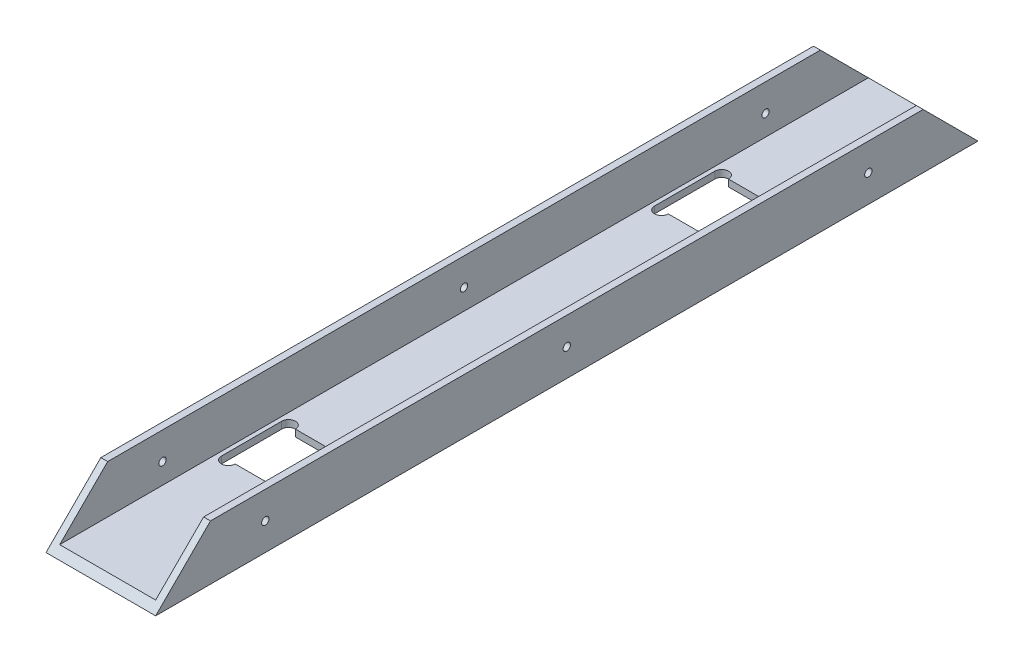
ISO-10303-21;
HEADER;
FILE_DESCRIPTION(('STEP AP214'),'2;1');
FILE_NAME('part.step','',(''),(''),'','','');
FILE_SCHEMA(('AUTOMOTIVE_DESIGN { 1 0 10303 214 1 1 1 1 }'));
ENDSEC;
DATA;
#1=APPLICATION_CONTEXT('core data for automotive mechanical design processes');
#2=APPLICATION_PROTOCOL_DEFINITION('international standard','automotive_design',2000,#1);
#3=PRODUCT_CONTEXT('',#1,'mechanical');
#4=PRODUCT('Part','Part','',(#3));
#5=PRODUCT_RELATED_PRODUCT_CATEGORY('part','',(#4));
#6=PRODUCT_DEFINITION_FORMATION('','',#4);
#7=PRODUCT_DEFINITION_CONTEXT('part definition',#1,'design');
#8=PRODUCT_DEFINITION('design','',#6,#7);
#9=PRODUCT_DEFINITION_SHAPE('','',#8);
#10=(LENGTH_UNIT() NAMED_UNIT(*) SI_UNIT(.MILLI.,.METRE.));
#11=(NAMED_UNIT(*) PLANE_ANGLE_UNIT() SI_UNIT($,.RADIAN.));
#12=(NAMED_UNIT(*) SI_UNIT($,.STERADIAN.) SOLID_ANGLE_UNIT());
#13=UNCERTAINTY_MEASURE_WITH_UNIT(LENGTH_MEASURE(1.E-05),#10,'distance_accuracy_value','');
#14=(GEOMETRIC_REPRESENTATION_CONTEXT(3) GLOBAL_UNCERTAINTY_ASSIGNED_CONTEXT((#13)) GLOBAL_UNIT_ASSIGNED_CONTEXT((#10,
#11,#12)) REPRESENTATION_CONTEXT('',''));
#15=CARTESIAN_POINT('',(0.,0.,0.));
#16=DIRECTION('',(0.,0.,1.));
#17=DIRECTION('',(1.,0.,0.));
#18=AXIS2_PLACEMENT_3D('',#15,#16,#17);
#19=CARTESIAN_POINT('',(-25.4,25.4,381.));
#20=DIRECTION('',(1.,0.,0.));
#21=DIRECTION('',(0.,1.,0.));
#22=AXIS2_PLACEMENT_3D('',#19,#20,#21);
#23=PLANE('',#22);
#24=CARTESIAN_POINT('',(-25.4,12.6999999999998,50.8));
#25=DIRECTION('',(-1.,0.,0.));
#26=DIRECTION('',(0.,0.,1.));
#27=AXIS2_PLACEMENT_3D('',#24,#25,#26);
#28=CIRCLE('',#27,1.69999999999999);
#29=CARTESIAN_POINT('',(-25.4,12.6999999999998,52.5));
#30=VERTEX_POINT('',#29);
#31=EDGE_CURVE('E451',#30,#30,#28,.T.);
#32=ORIENTED_EDGE('',*,*,#31,.F.);
#33=EDGE_LOOP('',(#32));
#34=FACE_BOUND('',#33,.T.);
#35=CARTESIAN_POINT('',(-25.4,12.7,190.5));
#36=DIRECTION('',(-1.,0.,0.));
#37=DIRECTION('',(0.,0.,1.));
#38=AXIS2_PLACEMENT_3D('',#35,#36,#37);
#39=CIRCLE('',#38,1.69999999999999);
#40=CARTESIAN_POINT('',(-25.4,12.7,192.2));
#41=VERTEX_POINT('',#40);
#42=EDGE_CURVE('E408',#41,#41,#39,.T.);
#43=ORIENTED_EDGE('',*,*,#42,.F.);
#44=EDGE_LOOP('',(#43));
#45=FACE_BOUND('',#44,.T.);
#46=DIRECTION('',(0.,0.,-1.));
#47=VECTOR('',#46,1.);
#48=CARTESIAN_POINT('',(-25.4,0.,381.));
#49=LINE('',#48,#47);
#50=CARTESIAN_POINT('',(-25.4,0.,381.));
#51=VERTEX_POINT('',#50);
#52=CARTESIAN_POINT('',(-25.4,0.,0.));
#53=VERTEX_POINT('',#52);
#54=EDGE_CURVE('E351',#51,#53,#49,.T.);
#55=ORIENTED_EDGE('',*,*,#54,.F.);
#56=DIRECTION('',(0.,0.707106781186549,-0.707106781186546));
#57=VECTOR('',#56,1.);
#58=CARTESIAN_POINT('',(-25.4,0.,381.));
#59=LINE('',#58,#57);
#60=CARTESIAN_POINT('',(-25.4,25.4,355.6));
#61=VERTEX_POINT('',#60);
#62=EDGE_CURVE('E291',#51,#61,#59,.T.);
#63=ORIENTED_EDGE('',*,*,#62,.T.);
#64=DIRECTION('',(0.,0.,-1.));
#65=VECTOR('',#64,1.);
#66=CARTESIAN_POINT('',(-25.4,25.4,381.));
#67=LINE('',#66,#65);
#68=CARTESIAN_POINT('',(-25.4,25.4,25.3999999999997));
#69=VERTEX_POINT('',#68);
#70=EDGE_CURVE('E328',#61,#69,#67,.T.);
#71=ORIENTED_EDGE('',*,*,#70,.T.);
#72=DIRECTION('',(0.,-0.707106781186551,-0.707106781186544));
#73=VECTOR('',#72,1.);
#74=CARTESIAN_POINT('',(-25.4,25.4,25.3999999999997));
#75=LINE('',#74,#73);
#76=EDGE_CURVE('E302',#69,#53,#75,.T.);
#77=ORIENTED_EDGE('',*,*,#76,.T.);
#78=EDGE_LOOP('',(#55,#63,#71,#77));
#79=FACE_BOUND('',#78,.T.);
#80=CARTESIAN_POINT('',(-25.4,12.6999999999998,330.2));
#81=DIRECTION('',(-1.,0.,0.));
#82=DIRECTION('',(0.,0.,1.));
#83=AXIS2_PLACEMENT_3D('',#80,#81,#82);
#84=CIRCLE('',#83,1.69999999999999);
#85=CARTESIAN_POINT('',(-25.4,12.6999999999998,331.9));
#86=VERTEX_POINT('',#85);
#87=EDGE_CURVE('E405',#86,#86,#84,.T.);
#88=ORIENTED_EDGE('',*,*,#87,.F.);
#89=EDGE_LOOP('',(#88));
#90=FACE_BOUND('',#89,.T.);
#91=ADVANCED_FACE('F35',(#34,#45,#79,#90),#23,.F.);
#92=CARTESIAN_POINT('',(-25.4,0.,381.));
#93=DIRECTION('',(0.,1.,0.));
#94=DIRECTION('',(-1.,0.,0.));
#95=AXIS2_PLACEMENT_3D('',#92,#93,#94);
#96=PLANE('',#95);
#97=DIRECTION('',(-1.,0.,0.));
#98=VECTOR('',#97,1.);
#99=CARTESIAN_POINT('',(-13.97,0.,304.8));
#100=LINE('',#99,#98);
#101=CARTESIAN_POINT('',(13.97,0.,304.8));
#102=VERTEX_POINT('',#101);
#103=CARTESIAN_POINT('',(-13.97,0.,304.8));
#104=VERTEX_POINT('',#103);
#105=EDGE_CURVE('E214',#102,#104,#100,.T.);
#106=ORIENTED_EDGE('',*,*,#105,.F.);
#107=CARTESIAN_POINT('',(17.145,0.,304.8));
#108=DIRECTION('',(0.,-1.,0.));
#109=DIRECTION('',(-1.,0.,0.));
#110=AXIS2_PLACEMENT_3D('',#107,#108,#109);
#111=CIRCLE('',#110,3.17500000000005);
#112=CARTESIAN_POINT('',(20.3200000000001,0.,304.8));
#113=VERTEX_POINT('',#112);
#114=EDGE_CURVE('E51',#113,#102,#111,.T.);
#115=ORIENTED_EDGE('',*,*,#114,.F.);
#116=DIRECTION('',(0.,0.,1.));
#117=VECTOR('',#116,1.);
#118=CARTESIAN_POINT('',(20.3200000000001,0.,276.86));
#119=LINE('',#118,#117);
#120=CARTESIAN_POINT('',(20.3200000000001,0.,276.86));
#121=VERTEX_POINT('',#120);
#122=EDGE_CURVE('E236',#121,#113,#119,.T.);
#123=ORIENTED_EDGE('',*,*,#122,.F.);
#124=CARTESIAN_POINT('',(17.145,0.,276.86));
#125=DIRECTION('',(0.,-1.,0.));
#126=DIRECTION('',(1.,0.,0.));
#127=AXIS2_PLACEMENT_3D('',#124,#125,#126);
#128=CIRCLE('',#127,3.17500000000005);
#129=CARTESIAN_POINT('',(13.9699999999999,0.,276.86));
#130=VERTEX_POINT('',#129);
#131=EDGE_CURVE('E233',#130,#121,#128,.T.);
#132=ORIENTED_EDGE('',*,*,#131,.F.);
#133=DIRECTION('',(1.,0.,0.));
#134=VECTOR('',#133,1.);
#135=CARTESIAN_POINT('',(-13.97,0.,276.86));
#136=LINE('',#135,#134);
#137=CARTESIAN_POINT('',(-13.97,0.,276.86));
#138=VERTEX_POINT('',#137);
#139=EDGE_CURVE('E230',#138,#130,#136,.T.);
#140=ORIENTED_EDGE('',*,*,#139,.F.);
#141=CARTESIAN_POINT('',(-17.145,0.,276.86));
#142=DIRECTION('',(0.,-1.,0.));
#143=DIRECTION('',(-1.,0.,0.));
#144=AXIS2_PLACEMENT_3D('',#141,#142,#143);
#145=CIRCLE('',#144,3.175);
#146=CARTESIAN_POINT('',(-20.32,0.,276.86));
#147=VERTEX_POINT('',#146);
#148=EDGE_CURVE('E224',#147,#138,#145,.T.);
#149=ORIENTED_EDGE('',*,*,#148,.F.);
#150=DIRECTION('',(0.,0.,-1.));
#151=VECTOR('',#150,1.);
#152=CARTESIAN_POINT('',(-20.32,0.,276.86));
#153=LINE('',#152,#151);
#154=CARTESIAN_POINT('',(-20.32,0.,304.8));
#155=VERTEX_POINT('',#154);
#156=EDGE_CURVE('E222',#155,#147,#153,.T.);
#157=ORIENTED_EDGE('',*,*,#156,.F.);
#158=CARTESIAN_POINT('',(-17.145,0.,304.8));
#159=DIRECTION('',(0.,-1.,0.));
#160=DIRECTION('',(1.,0.,0.));
#161=AXIS2_PLACEMENT_3D('',#158,#159,#160);
#162=CIRCLE('',#161,3.175);
#163=EDGE_CURVE('E204',#104,#155,#162,.T.);
#164=ORIENTED_EDGE('',*,*,#163,.F.);
#165=EDGE_LOOP('',(#106,#115,#123,#132,#140,#149,#157,#164));
#166=FACE_BOUND('',#165,.T.);
#167=DIRECTION('',(1.,0.,0.));
#168=VECTOR('',#167,1.);
#169=CARTESIAN_POINT('',(-13.97,0.,76.1999999999999));
#170=LINE('',#169,#168);
#171=CARTESIAN_POINT('',(-13.97,0.,76.1999999999999));
#172=VERTEX_POINT('',#171);
#173=CARTESIAN_POINT('',(13.97,0.,76.1999999999999));
#174=VERTEX_POINT('',#173);
#175=EDGE_CURVE('E253',#172,#174,#170,.T.);
#176=ORIENTED_EDGE('',*,*,#175,.F.);
#177=CARTESIAN_POINT('',(-17.145,0.,76.1999999999999));
#178=DIRECTION('',(0.,-1.,0.));
#179=DIRECTION('',(-1.,0.,0.));
#180=AXIS2_PLACEMENT_3D('',#177,#178,#179);
#181=CIRCLE('',#180,3.175);
#182=CARTESIAN_POINT('',(-20.32,0.,76.2));
#183=VERTEX_POINT('',#182);
#184=EDGE_CURVE('E59',#183,#172,#181,.T.);
#185=ORIENTED_EDGE('',*,*,#184,.F.);
#186=DIRECTION('',(0.,0.,-1.));
#187=VECTOR('',#186,1.);
#188=CARTESIAN_POINT('',(-20.32,0.,104.14));
#189=LINE('',#188,#187);
#190=CARTESIAN_POINT('',(-20.32,0.,104.14));
#191=VERTEX_POINT('',#190);
#192=EDGE_CURVE('E272',#191,#183,#189,.T.);
#193=ORIENTED_EDGE('',*,*,#192,.F.);
#194=CARTESIAN_POINT('',(-17.145,0.,104.14));
#195=DIRECTION('',(0.,-1.,0.));
#196=DIRECTION('',(1.,0.,0.));
#197=AXIS2_PLACEMENT_3D('',#194,#195,#196);
#198=CIRCLE('',#197,3.175);
#199=CARTESIAN_POINT('',(-13.97,0.,104.14));
#200=VERTEX_POINT('',#199);
#201=EDGE_CURVE('E269',#200,#191,#198,.T.);
#202=ORIENTED_EDGE('',*,*,#201,.F.);
#203=DIRECTION('',(-1.,0.,0.));
#204=VECTOR('',#203,1.);
#205=CARTESIAN_POINT('',(-13.97,0.,104.14));
#206=LINE('',#205,#204);
#207=CARTESIAN_POINT('',(13.9699999999999,0.,104.14));
#208=VERTEX_POINT('',#207);
#209=EDGE_CURVE('E266',#208,#200,#206,.T.);
#210=ORIENTED_EDGE('',*,*,#209,.F.);
#211=CARTESIAN_POINT('',(17.145,0.,104.14));
#212=DIRECTION('',(0.,-1.,0.));
#213=DIRECTION('',(-1.,0.,0.));
#214=AXIS2_PLACEMENT_3D('',#211,#212,#213);
#215=CIRCLE('',#214,3.17500000000005);
#216=CARTESIAN_POINT('',(20.3200000000001,0.,104.14));
#217=VERTEX_POINT('',#216);
#218=EDGE_CURVE('E263',#217,#208,#215,.T.);
#219=ORIENTED_EDGE('',*,*,#218,.F.);
#220=DIRECTION('',(0.,0.,1.));
#221=VECTOR('',#220,1.);
#222=CARTESIAN_POINT('',(20.3200000000001,0.,104.14));
#223=LINE('',#222,#221);
#224=CARTESIAN_POINT('',(20.32,0.,76.1999999999999));
#225=VERTEX_POINT('',#224);
#226=EDGE_CURVE('E260',#225,#217,#223,.T.);
#227=ORIENTED_EDGE('',*,*,#226,.F.);
#228=CARTESIAN_POINT('',(17.145,0.,76.1999999999999));
#229=DIRECTION('',(0.,-1.,0.));
#230=DIRECTION('',(1.,0.,0.));
#231=AXIS2_PLACEMENT_3D('',#228,#229,#230);
#232=CIRCLE('',#231,3.17500000000005);
#233=EDGE_CURVE('E257',#174,#225,#232,.T.);
#234=ORIENTED_EDGE('',*,*,#233,.F.);
#235=EDGE_LOOP('',(#176,#185,#193,#202,#210,#219,#227,#234));
#236=FACE_BOUND('',#235,.T.);
#237=DIRECTION('',(1.,0.,0.));
#238=VECTOR('',#237,1.);
#239=CARTESIAN_POINT('',(-25.4,0.,0.));
#240=LINE('',#239,#238);
#241=CARTESIAN_POINT('',(25.4,0.,0.));
#242=VERTEX_POINT('',#241);
#243=EDGE_CURVE('E325',#53,#242,#240,.T.);
#244=ORIENTED_EDGE('',*,*,#243,.T.);
#245=DIRECTION('',(0.,0.,-1.));
#246=VECTOR('',#245,1.);
#247=CARTESIAN_POINT('',(25.4,0.,381.));
#248=LINE('',#247,#246);
#249=CARTESIAN_POINT('',(25.4,0.,381.));
#250=VERTEX_POINT('',#249);
#251=EDGE_CURVE('E348',#250,#242,#248,.T.);
#252=ORIENTED_EDGE('',*,*,#251,.F.);
#253=DIRECTION('',(1.,0.,0.));
#254=VECTOR('',#253,1.);
#255=CARTESIAN_POINT('',(-25.4,0.,381.));
#256=LINE('',#255,#254);
#257=EDGE_CURVE('E326',#51,#250,#256,.T.);
#258=ORIENTED_EDGE('',*,*,#257,.F.);
#259=ORIENTED_EDGE('',*,*,#54,.T.);
#260=EDGE_LOOP('',(#244,#252,#258,#259));
#261=FACE_BOUND('',#260,.T.);
#262=ADVANCED_FACE('F218',(#166,#236,#261),#96,.F.);
#263=CARTESIAN_POINT('',(25.4,0.,381.));
#264=DIRECTION('',(-1.,0.,0.));
#265=DIRECTION('',(0.,0.,1.));
#266=AXIS2_PLACEMENT_3D('',#263,#264,#265);
#267=PLANE('',#266);
#268=CARTESIAN_POINT('',(25.4,12.6999999999998,50.8));
#269=DIRECTION('',(-1.,0.,0.));
#270=DIRECTION('',(0.,0.,1.));
#271=AXIS2_PLACEMENT_3D('',#268,#269,#270);
#272=CIRCLE('',#271,1.69999999999999);
#273=CARTESIAN_POINT('',(25.4,12.6999999999998,52.5));
#274=VERTEX_POINT('',#273);
#275=EDGE_CURVE('E515',#274,#274,#272,.T.);
#276=ORIENTED_EDGE('',*,*,#275,.T.);
#277=EDGE_LOOP('',(#276));
#278=FACE_BOUND('',#277,.T.);
#279=CARTESIAN_POINT('',(25.4,12.7,190.5));
#280=DIRECTION('',(-1.,0.,0.));
#281=DIRECTION('',(0.,0.,1.));
#282=AXIS2_PLACEMENT_3D('',#279,#280,#281);
#283=CIRCLE('',#282,1.69999999999999);
#284=CARTESIAN_POINT('',(25.4,12.7,192.2));
#285=VERTEX_POINT('',#284);
#286=EDGE_CURVE('E401',#285,#285,#283,.T.);
#287=ORIENTED_EDGE('',*,*,#286,.T.);
#288=EDGE_LOOP('',(#287));
#289=FACE_BOUND('',#288,.T.);
#290=CARTESIAN_POINT('',(25.4,12.6999999999998,330.2));
#291=DIRECTION('',(-1.,0.,0.));
#292=DIRECTION('',(0.,0.,1.));
#293=AXIS2_PLACEMENT_3D('',#290,#291,#292);
#294=CIRCLE('',#293,1.69999999999999);
#295=CARTESIAN_POINT('',(25.4,12.6999999999998,331.9));
#296=VERTEX_POINT('',#295);
#297=EDGE_CURVE('E397',#296,#296,#294,.T.);
#298=ORIENTED_EDGE('',*,*,#297,.T.);
#299=EDGE_LOOP('',(#298));
#300=FACE_BOUND('',#299,.T.);
#301=DIRECTION('',(0.,0.,-1.));
#302=VECTOR('',#301,1.);
#303=CARTESIAN_POINT('',(25.4,25.4,381.));
#304=LINE('',#303,#302);
#305=CARTESIAN_POINT('',(25.4,25.4,355.6));
#306=VERTEX_POINT('',#305);
#307=CARTESIAN_POINT('',(25.4,25.4,25.3999999999997));
#308=VERTEX_POINT('',#307);
#309=EDGE_CURVE('E345',#306,#308,#304,.T.);
#310=ORIENTED_EDGE('',*,*,#309,.F.);
#311=DIRECTION('',(0.,0.707106781186549,-0.707106781186546));
#312=VECTOR('',#311,1.);
#313=CARTESIAN_POINT('',(25.4,0.,381.));
#314=LINE('',#313,#312);
#315=EDGE_CURVE('E295',#250,#306,#314,.T.);
#316=ORIENTED_EDGE('',*,*,#315,.F.);
#317=ORIENTED_EDGE('',*,*,#251,.T.);
#318=DIRECTION('',(0.,-0.707106781186551,-0.707106781186544));
#319=VECTOR('',#318,1.);
#320=CARTESIAN_POINT('',(25.4,25.4,25.3999999999997));
#321=LINE('',#320,#319);
#322=EDGE_CURVE('E241',#308,#242,#321,.T.);
#323=ORIENTED_EDGE('',*,*,#322,.F.);
#324=EDGE_LOOP('',(#310,#316,#317,#323));
#325=FACE_BOUND('',#324,.T.);
#326=ADVANCED_FACE('F447',(#278,#289,#300,#325),#267,.F.);
#327=CARTESIAN_POINT('',(25.4,25.4,381.));
#328=DIRECTION('',(0.,-1.,0.));
#329=DIRECTION('',(0.,0.,-1.));
#330=AXIS2_PLACEMENT_3D('',#327,#328,#329);
#331=PLANE('',#330);
#332=DIRECTION('',(0.,0.,-1.));
#333=VECTOR('',#332,1.);
#334=CARTESIAN_POINT('',(22.225,25.4,381.));
#335=LINE('',#334,#333);
#336=CARTESIAN_POINT('',(22.225,25.4,355.6));
#337=VERTEX_POINT('',#336);
#338=CARTESIAN_POINT('',(22.225,25.4,25.3999999999997));
#339=VERTEX_POINT('',#338);
#340=EDGE_CURVE('E342',#337,#339,#335,.T.);
#341=ORIENTED_EDGE('',*,*,#340,.F.);
#342=DIRECTION('',(1.,0.,0.));
#343=VECTOR('',#342,1.);
#344=CARTESIAN_POINT('',(-25.4,25.4,355.6));
#345=LINE('',#344,#343);
#346=EDGE_CURVE('E294',#337,#306,#345,.T.);
#347=ORIENTED_EDGE('',*,*,#346,.T.);
#348=ORIENTED_EDGE('',*,*,#309,.T.);
#349=DIRECTION('',(1.,0.,0.));
#350=VECTOR('',#349,1.);
#351=CARTESIAN_POINT('',(-25.4,25.4,25.3999999999997));
#352=LINE('',#351,#350);
#353=EDGE_CURVE('E305',#339,#308,#352,.T.);
#354=ORIENTED_EDGE('',*,*,#353,.F.);
#355=EDGE_LOOP('',(#341,#347,#348,#354));
#356=FACE_BOUND('',#355,.T.);
#357=ADVANCED_FACE('F486',(#356),#331,.F.);
#358=CARTESIAN_POINT('',(22.225,25.4,381.));
#359=DIRECTION('',(1.,0.,0.));
#360=DIRECTION('',(0.,0.,-1.));
#361=AXIS2_PLACEMENT_3D('',#358,#359,#360);
#362=PLANE('',#361);
#363=CARTESIAN_POINT('',(22.225,12.6999999999998,50.8));
#364=DIRECTION('',(1.,0.,0.));
#365=DIRECTION('',(0.,0.,-1.));
#366=AXIS2_PLACEMENT_3D('',#363,#364,#365);
#367=CIRCLE('',#366,1.69999999999999);
#368=CARTESIAN_POINT('',(22.225,12.6999999999998,49.1));
#369=VERTEX_POINT('',#368);
#370=EDGE_CURVE('E413',#369,#369,#367,.T.);
#371=ORIENTED_EDGE('',*,*,#370,.T.);
#372=EDGE_LOOP('',(#371));
#373=FACE_BOUND('',#372,.T.);
#374=CARTESIAN_POINT('',(22.225,12.7,190.5));
#375=DIRECTION('',(1.,0.,0.));
#376=DIRECTION('',(0.,0.,-1.));
#377=AXIS2_PLACEMENT_3D('',#374,#375,#376);
#378=CIRCLE('',#377,1.69999999999999);
#379=CARTESIAN_POINT('',(22.225,12.7,188.8));
#380=VERTEX_POINT('',#379);
#381=EDGE_CURVE('E400',#380,#380,#378,.T.);
#382=ORIENTED_EDGE('',*,*,#381,.T.);
#383=EDGE_LOOP('',(#382));
#384=FACE_BOUND('',#383,.T.);
#385=CARTESIAN_POINT('',(22.225,12.6999999999998,330.2));
#386=DIRECTION('',(1.,0.,0.));
#387=DIRECTION('',(0.,0.,-1.));
#388=AXIS2_PLACEMENT_3D('',#385,#386,#387);
#389=CIRCLE('',#388,1.69999999999999);
#390=CARTESIAN_POINT('',(22.225,12.6999999999998,328.5));
#391=VERTEX_POINT('',#390);
#392=EDGE_CURVE('E254',#391,#391,#389,.T.);
#393=ORIENTED_EDGE('',*,*,#392,.T.);
#394=EDGE_LOOP('',(#393));
#395=FACE_BOUND('',#394,.T.);
#396=DIRECTION('',(0.,0.,-1.));
#397=VECTOR('',#396,1.);
#398=CARTESIAN_POINT('',(22.225,3.175,381.));
#399=LINE('',#398,#397);
#400=CARTESIAN_POINT('',(22.225,3.175,377.825));
#401=VERTEX_POINT('',#400);
#402=CARTESIAN_POINT('',(22.225,3.175,3.17500000000004));
#403=VERTEX_POINT('',#402);
#404=EDGE_CURVE('E339',#401,#403,#399,.T.);
#405=ORIENTED_EDGE('',*,*,#404,.F.);
#406=DIRECTION('',(0.,0.707106781186549,-0.707106781186546));
#407=VECTOR('',#406,1.);
#408=CARTESIAN_POINT('',(22.225,12.7,368.3));
#409=LINE('',#408,#407);
#410=EDGE_CURVE('E322',#401,#337,#409,.T.);
#411=ORIENTED_EDGE('',*,*,#410,.T.);
#412=ORIENTED_EDGE('',*,*,#340,.T.);
#413=DIRECTION('',(0.,-0.707106781186551,-0.707106781186544));
#414=VECTOR('',#413,1.);
#415=CARTESIAN_POINT('',(22.225,203.2,203.199999999998));
#416=LINE('',#415,#414);
#417=EDGE_CURVE('E313',#339,#403,#416,.T.);
#418=ORIENTED_EDGE('',*,*,#417,.T.);
#419=EDGE_LOOP('',(#405,#411,#412,#418));
#420=FACE_BOUND('',#419,.T.);
#421=ADVANCED_FACE('F424',(#373,#384,#395,#420),#362,.F.);
#422=CARTESIAN_POINT('',(22.225,3.175,381.));
#423=DIRECTION('',(0.,-1.,0.));
#424=DIRECTION('',(1.,0.,0.));
#425=AXIS2_PLACEMENT_3D('',#422,#423,#424);
#426=PLANE('',#425);
#427=DIRECTION('',(0.,0.,1.));
#428=VECTOR('',#427,1.);
#429=CARTESIAN_POINT('',(20.3200000000001,3.175,381.));
#430=LINE('',#429,#428);
#431=CARTESIAN_POINT('',(20.3200000000001,3.175,276.86));
#432=VERTEX_POINT('',#431);
#433=CARTESIAN_POINT('',(20.3200000000001,3.175,304.8));
#434=VERTEX_POINT('',#433);
#435=EDGE_CURVE('E43',#432,#434,#430,.T.);
#436=ORIENTED_EDGE('',*,*,#435,.T.);
#437=CARTESIAN_POINT('',(17.145,3.175,304.8));
#438=DIRECTION('',(0.,-1.,0.));
#439=DIRECTION('',(1.,0.,0.));
#440=AXIS2_PLACEMENT_3D('',#437,#438,#439);
#441=CIRCLE('',#440,3.17500000000005);
#442=CARTESIAN_POINT('',(13.97,3.175,304.8));
#443=VERTEX_POINT('',#442);
#444=EDGE_CURVE('E11',#434,#443,#441,.T.);
#445=ORIENTED_EDGE('',*,*,#444,.T.);
#446=DIRECTION('',(-1.,0.,0.));
#447=VECTOR('',#446,1.);
#448=CARTESIAN_POINT('',(22.225,3.175,304.8));
#449=LINE('',#448,#447);
#450=CARTESIAN_POINT('',(-13.97,3.175,304.8));
#451=VERTEX_POINT('',#450);
#452=EDGE_CURVE('E378',#443,#451,#449,.T.);
#453=ORIENTED_EDGE('',*,*,#452,.T.);
#454=CARTESIAN_POINT('',(-17.145,3.175,304.8));
#455=DIRECTION('',(0.,-1.,0.));
#456=DIRECTION('',(1.,0.,0.));
#457=AXIS2_PLACEMENT_3D('',#454,#455,#456);
#458=CIRCLE('',#457,3.175);
#459=CARTESIAN_POINT('',(-20.32,3.175,304.8));
#460=VERTEX_POINT('',#459);
#461=EDGE_CURVE('E207',#451,#460,#458,.T.);
#462=ORIENTED_EDGE('',*,*,#461,.T.);
#463=DIRECTION('',(0.,0.,-1.));
#464=VECTOR('',#463,1.);
#465=CARTESIAN_POINT('',(-20.32,3.175,381.));
#466=LINE('',#465,#464);
#467=CARTESIAN_POINT('',(-20.32,3.175,276.86));
#468=VERTEX_POINT('',#467);
#469=EDGE_CURVE('E381',#460,#468,#466,.T.);
#470=ORIENTED_EDGE('',*,*,#469,.T.);
#471=CARTESIAN_POINT('',(-17.145,3.175,276.86));
#472=DIRECTION('',(0.,-1.,0.));
#473=DIRECTION('',(1.,0.,0.));
#474=AXIS2_PLACEMENT_3D('',#471,#472,#473);
#475=CIRCLE('',#474,3.175);
#476=CARTESIAN_POINT('',(-13.97,3.175,276.86));
#477=VERTEX_POINT('',#476);
#478=EDGE_CURVE('E384',#468,#477,#475,.T.);
#479=ORIENTED_EDGE('',*,*,#478,.T.);
#480=DIRECTION('',(1.,0.,0.));
#481=VECTOR('',#480,1.);
#482=CARTESIAN_POINT('',(22.225,3.175,276.86));
#483=LINE('',#482,#481);
#484=CARTESIAN_POINT('',(13.9699999999999,3.175,276.86));
#485=VERTEX_POINT('',#484);
#486=EDGE_CURVE('E387',#477,#485,#483,.T.);
#487=ORIENTED_EDGE('',*,*,#486,.T.);
#488=CARTESIAN_POINT('',(17.145,3.175,276.86));
#489=DIRECTION('',(0.,-1.,0.));
#490=DIRECTION('',(1.,0.,0.));
#491=AXIS2_PLACEMENT_3D('',#488,#489,#490);
#492=CIRCLE('',#491,3.17500000000005);
#493=EDGE_CURVE('E390',#485,#432,#492,.T.);
#494=ORIENTED_EDGE('',*,*,#493,.T.);
#495=EDGE_LOOP('',(#436,#445,#453,#462,#470,#479,#487,#494));
#496=FACE_BOUND('',#495,.T.);
#497=DIRECTION('',(0.,0.,-1.));
#498=VECTOR('',#497,1.);
#499=CARTESIAN_POINT('',(-20.32,3.175,381.));
#500=LINE('',#499,#498);
#501=CARTESIAN_POINT('',(-20.32,3.175,104.14));
#502=VERTEX_POINT('',#501);
#503=CARTESIAN_POINT('',(-20.32,3.175,76.2));
#504=VERTEX_POINT('',#503);
#505=EDGE_CURVE('E372',#502,#504,#500,.T.);
#506=ORIENTED_EDGE('',*,*,#505,.T.);
#507=CARTESIAN_POINT('',(-17.145,3.175,76.1999999999999));
#508=DIRECTION('',(0.,-1.,0.));
#509=DIRECTION('',(1.,0.,0.));
#510=AXIS2_PLACEMENT_3D('',#507,#508,#509);
#511=CIRCLE('',#510,3.175);
#512=CARTESIAN_POINT('',(-13.97,3.175,76.1999999999999));
#513=VERTEX_POINT('',#512);
#514=EDGE_CURVE('E375',#504,#513,#511,.T.);
#515=ORIENTED_EDGE('',*,*,#514,.T.);
#516=DIRECTION('',(1.,0.,0.));
#517=VECTOR('',#516,1.);
#518=CARTESIAN_POINT('',(22.225,3.175,76.1999999999999));
#519=LINE('',#518,#517);
#520=CARTESIAN_POINT('',(13.97,3.175,76.1999999999999));
#521=VERTEX_POINT('',#520);
#522=EDGE_CURVE('E354',#513,#521,#519,.T.);
#523=ORIENTED_EDGE('',*,*,#522,.T.);
#524=CARTESIAN_POINT('',(17.145,3.175,76.1999999999999));
#525=DIRECTION('',(0.,-1.,0.));
#526=DIRECTION('',(1.,0.,0.));
#527=AXIS2_PLACEMENT_3D('',#524,#525,#526);
#528=CIRCLE('',#527,3.17500000000005);
#529=CARTESIAN_POINT('',(20.32,3.175,76.1999999999999));
#530=VERTEX_POINT('',#529);
#531=EDGE_CURVE('E357',#521,#530,#528,.T.);
#532=ORIENTED_EDGE('',*,*,#531,.T.);
#533=DIRECTION('',(0.,0.,1.));
#534=VECTOR('',#533,1.);
#535=CARTESIAN_POINT('',(20.3200000000001,3.175,381.));
#536=LINE('',#535,#534);
#537=CARTESIAN_POINT('',(20.3200000000001,3.175,104.14));
#538=VERTEX_POINT('',#537);
#539=EDGE_CURVE('E360',#530,#538,#536,.T.);
#540=ORIENTED_EDGE('',*,*,#539,.T.);
#541=CARTESIAN_POINT('',(17.145,3.175,104.14));
#542=DIRECTION('',(0.,-1.,0.));
#543=DIRECTION('',(1.,0.,0.));
#544=AXIS2_PLACEMENT_3D('',#541,#542,#543);
#545=CIRCLE('',#544,3.17500000000005);
#546=CARTESIAN_POINT('',(13.9699999999999,3.175,104.14));
#547=VERTEX_POINT('',#546);
#548=EDGE_CURVE('E363',#538,#547,#545,.T.);
#549=ORIENTED_EDGE('',*,*,#548,.T.);
#550=DIRECTION('',(-1.,0.,0.));
#551=VECTOR('',#550,1.);
#552=CARTESIAN_POINT('',(22.225,3.175,104.14));
#553=LINE('',#552,#551);
#554=CARTESIAN_POINT('',(-13.97,3.175,104.14));
#555=VERTEX_POINT('',#554);
#556=EDGE_CURVE('E366',#547,#555,#553,.T.);
#557=ORIENTED_EDGE('',*,*,#556,.T.);
#558=CARTESIAN_POINT('',(-17.145,3.175,104.14));
#559=DIRECTION('',(0.,-1.,0.));
#560=DIRECTION('',(1.,0.,0.));
#561=AXIS2_PLACEMENT_3D('',#558,#559,#560);
#562=CIRCLE('',#561,3.175);
#563=EDGE_CURVE('E369',#555,#502,#562,.T.);
#564=ORIENTED_EDGE('',*,*,#563,.T.);
#565=EDGE_LOOP('',(#506,#515,#523,#532,#540,#549,#557,#564));
#566=FACE_BOUND('',#565,.T.);
#567=DIRECTION('',(0.,0.,-1.));
#568=VECTOR('',#567,1.);
#569=CARTESIAN_POINT('',(-22.225,3.175,381.));
#570=LINE('',#569,#568);
#571=CARTESIAN_POINT('',(-22.225,3.175,377.825));
#572=VERTEX_POINT('',#571);
#573=CARTESIAN_POINT('',(-22.225,3.17500000000004,3.17500000000009));
#574=VERTEX_POINT('',#573);
#575=EDGE_CURVE('E336',#572,#574,#570,.T.);
#576=ORIENTED_EDGE('',*,*,#575,.F.);
#577=DIRECTION('',(1.,0.,0.));
#578=VECTOR('',#577,1.);
#579=CARTESIAN_POINT('',(22.225,3.175,377.825));
#580=LINE('',#579,#578);
#581=EDGE_CURVE('E319',#572,#401,#580,.T.);
#582=ORIENTED_EDGE('',*,*,#581,.T.);
#583=ORIENTED_EDGE('',*,*,#404,.T.);
#584=DIRECTION('',(-1.,0.,0.));
#585=VECTOR('',#584,1.);
#586=CARTESIAN_POINT('',(22.225,3.175,3.17500000000004));
#587=LINE('',#586,#585);
#588=EDGE_CURVE('E310',#403,#574,#587,.T.);
#589=ORIENTED_EDGE('',*,*,#588,.T.);
#590=EDGE_LOOP('',(#576,#582,#583,#589));
#591=FACE_BOUND('',#590,.T.);
#592=ADVANCED_FACE('F464',(#496,#566,#591),#426,.F.);
#593=CARTESIAN_POINT('',(-22.225,3.175,381.));
#594=DIRECTION('',(-1.,0.,0.));
#595=DIRECTION('',(0.,0.,1.));
#596=AXIS2_PLACEMENT_3D('',#593,#594,#595);
#597=PLANE('',#596);
#598=CARTESIAN_POINT('',(-22.225,12.6999999999998,50.8));
#599=DIRECTION('',(-1.,0.,0.));
#600=DIRECTION('',(0.,0.,1.));
#601=AXIS2_PLACEMENT_3D('',#598,#599,#600);
#602=CIRCLE('',#601,1.69999999999999);
#603=CARTESIAN_POINT('',(-22.225,12.6999999999998,52.5));
#604=VERTEX_POINT('',#603);
#605=EDGE_CURVE('E38',#604,#604,#602,.T.);
#606=ORIENTED_EDGE('',*,*,#605,.T.);
#607=EDGE_LOOP('',(#606));
#608=FACE_BOUND('',#607,.T.);
#609=CARTESIAN_POINT('',(-22.225,12.7,190.5));
#610=DIRECTION('',(-1.,0.,0.));
#611=DIRECTION('',(0.,0.,1.));
#612=AXIS2_PLACEMENT_3D('',#609,#610,#611);
#613=CIRCLE('',#612,1.69999999999999);
#614=CARTESIAN_POINT('',(-22.225,12.7,192.2));
#615=VERTEX_POINT('',#614);
#616=EDGE_CURVE('E398',#615,#615,#613,.T.);
#617=ORIENTED_EDGE('',*,*,#616,.T.);
#618=EDGE_LOOP('',(#617));
#619=FACE_BOUND('',#618,.T.);
#620=CARTESIAN_POINT('',(-22.225,12.6999999999998,330.2));
#621=DIRECTION('',(-1.,0.,0.));
#622=DIRECTION('',(0.,0.,1.));
#623=AXIS2_PLACEMENT_3D('',#620,#621,#622);
#624=CIRCLE('',#623,1.69999999999999);
#625=CARTESIAN_POINT('',(-22.225,12.6999999999998,331.9));
#626=VERTEX_POINT('',#625);
#627=EDGE_CURVE('E395',#626,#626,#624,.T.);
#628=ORIENTED_EDGE('',*,*,#627,.T.);
#629=EDGE_LOOP('',(#628));
#630=FACE_BOUND('',#629,.T.);
#631=DIRECTION('',(0.,0.,-1.));
#632=VECTOR('',#631,1.);
#633=CARTESIAN_POINT('',(-22.225,25.4,381.));
#634=LINE('',#633,#632);
#635=CARTESIAN_POINT('',(-22.225,25.4,355.6));
#636=VERTEX_POINT('',#635);
#637=CARTESIAN_POINT('',(-22.225,25.4,25.3999999999997));
#638=VERTEX_POINT('',#637);
#639=EDGE_CURVE('E333',#636,#638,#634,.T.);
#640=ORIENTED_EDGE('',*,*,#639,.F.);
#641=DIRECTION('',(0.,-0.707106781186549,0.707106781186546));
#642=VECTOR('',#641,1.);
#643=CARTESIAN_POINT('',(-22.225,1.58750000000001,379.4125));
#644=LINE('',#643,#642);
#645=EDGE_CURVE('E316',#636,#572,#644,.T.);
#646=ORIENTED_EDGE('',*,*,#645,.T.);
#647=ORIENTED_EDGE('',*,*,#575,.T.);
#648=DIRECTION('',(0.,0.707106781186551,0.707106781186544));
#649=VECTOR('',#648,1.);
#650=CARTESIAN_POINT('',(-22.225,192.0875,192.087499999998));
#651=LINE('',#650,#649);
#652=EDGE_CURVE('E301',#574,#638,#651,.T.);
#653=ORIENTED_EDGE('',*,*,#652,.T.);
#654=EDGE_LOOP('',(#640,#646,#647,#653));
#655=FACE_BOUND('',#654,.T.);
#656=ADVANCED_FACE('F460',(#608,#619,#630,#655),#597,.F.);
#657=CARTESIAN_POINT('',(-22.225,25.4,381.));
#658=DIRECTION('',(0.,-1.,0.));
#659=DIRECTION('',(0.,0.,-1.));
#660=AXIS2_PLACEMENT_3D('',#657,#658,#659);
#661=PLANE('',#660);
#662=ORIENTED_EDGE('',*,*,#70,.F.);
#663=EDGE_CURVE('E298',#61,#636,#345,.T.);
#664=ORIENTED_EDGE('',*,*,#663,.T.);
#665=ORIENTED_EDGE('',*,*,#639,.T.);
#666=EDGE_CURVE('E297',#69,#638,#352,.T.);
#667=ORIENTED_EDGE('',*,*,#666,.F.);
#668=EDGE_LOOP('',(#662,#664,#665,#667));
#669=FACE_BOUND('',#668,.T.);
#670=ADVANCED_FACE('F463',(#669),#661,.F.);
#671=CARTESIAN_POINT('',(-25.4,25.4,25.3999999999997));
#672=DIRECTION('',(0.,-0.707106781186544,0.707106781186551));
#673=DIRECTION('',(0.,-0.707106781186551,-0.707106781186544));
#674=AXIS2_PLACEMENT_3D('',#671,#672,#673);
#675=PLANE('',#674);
#676=ORIENTED_EDGE('',*,*,#353,.T.);
#677=ORIENTED_EDGE('',*,*,#322,.T.);
#678=ORIENTED_EDGE('',*,*,#243,.F.);
#679=ORIENTED_EDGE('',*,*,#76,.F.);
#680=ORIENTED_EDGE('',*,*,#666,.T.);
#681=ORIENTED_EDGE('',*,*,#652,.F.);
#682=ORIENTED_EDGE('',*,*,#588,.F.);
#683=ORIENTED_EDGE('',*,*,#417,.F.);
#684=EDGE_LOOP('',(#676,#677,#678,#679,#680,#681,#682,#683));
#685=FACE_BOUND('',#684,.T.);
#686=ADVANCED_FACE('F489',(#685),#675,.F.);
#687=CARTESIAN_POINT('',(-25.4,0.,381.));
#688=DIRECTION('',(0.,-0.707106781186546,-0.707106781186549));
#689=DIRECTION('',(0.,0.707106781186549,-0.707106781186546));
#690=AXIS2_PLACEMENT_3D('',#687,#688,#689);
#691=PLANE('',#690);
#692=ORIENTED_EDGE('',*,*,#581,.F.);
#693=ORIENTED_EDGE('',*,*,#645,.F.);
#694=ORIENTED_EDGE('',*,*,#663,.F.);
#695=ORIENTED_EDGE('',*,*,#62,.F.);
#696=ORIENTED_EDGE('',*,*,#257,.T.);
#697=ORIENTED_EDGE('',*,*,#315,.T.);
#698=ORIENTED_EDGE('',*,*,#346,.F.);
#699=ORIENTED_EDGE('',*,*,#410,.F.);
#700=EDGE_LOOP('',(#692,#693,#694,#695,#696,#697,#698,#699));
#701=FACE_BOUND('',#700,.T.);
#702=ADVANCED_FACE('F473',(#701),#691,.F.);
#703=CARTESIAN_POINT('',(-17.145,25.4,76.1999999999999));
#704=DIRECTION('',(0.,-1.,0.));
#705=DIRECTION('',(1.,0.,0.));
#706=AXIS2_PLACEMENT_3D('',#703,#704,#705);
#707=CYLINDRICAL_SURFACE('',#706,3.175);
#708=DIRECTION('',(0.,-1.,0.));
#709=VECTOR('',#708,1.);
#710=CARTESIAN_POINT('',(-20.32,25.4,76.2));
#711=LINE('',#710,#709);
#712=EDGE_CURVE('E276',#504,#183,#711,.T.);
#713=ORIENTED_EDGE('',*,*,#712,.T.);
#714=ORIENTED_EDGE('',*,*,#184,.T.);
#715=DIRECTION('',(0.,-1.,0.));
#716=VECTOR('',#715,1.);
#717=CARTESIAN_POINT('',(-13.97,25.4,76.1999999999999));
#718=LINE('',#717,#716);
#719=EDGE_CURVE('E275',#513,#172,#718,.T.);
#720=ORIENTED_EDGE('',*,*,#719,.F.);
#721=ORIENTED_EDGE('',*,*,#514,.F.);
#722=EDGE_LOOP('',(#713,#714,#720,#721));
#723=FACE_BOUND('',#722,.T.);
#724=ADVANCED_FACE('F496',(#723),#707,.F.);
#725=CARTESIAN_POINT('',(-20.32,25.4,104.14));
#726=DIRECTION('',(-1.,0.,0.));
#727=DIRECTION('',(0.,-1.,0.));
#728=AXIS2_PLACEMENT_3D('',#725,#726,#727);
#729=PLANE('',#728);
#730=DIRECTION('',(0.,-1.,0.));
#731=VECTOR('',#730,1.);
#732=CARTESIAN_POINT('',(-20.32,25.4,104.14));
#733=LINE('',#732,#731);
#734=EDGE_CURVE('E278',#502,#191,#733,.T.);
#735=ORIENTED_EDGE('',*,*,#734,.T.);
#736=ORIENTED_EDGE('',*,*,#192,.T.);
#737=ORIENTED_EDGE('',*,*,#712,.F.);
#738=ORIENTED_EDGE('',*,*,#505,.F.);
#739=EDGE_LOOP('',(#735,#736,#737,#738));
#740=FACE_BOUND('',#739,.T.);
#741=ADVANCED_FACE('F709',(#740),#729,.F.);
#742=CARTESIAN_POINT('',(-17.145,25.4,104.14));
#743=DIRECTION('',(0.,-1.,0.));
#744=DIRECTION('',(1.,0.,0.));
#745=AXIS2_PLACEMENT_3D('',#742,#743,#744);
#746=CYLINDRICAL_SURFACE('',#745,3.175);
#747=DIRECTION('',(0.,-1.,0.));
#748=VECTOR('',#747,1.);
#749=CARTESIAN_POINT('',(-13.97,25.4,104.14));
#750=LINE('',#749,#748);
#751=EDGE_CURVE('E280',#555,#200,#750,.T.);
#752=ORIENTED_EDGE('',*,*,#751,.T.);
#753=ORIENTED_EDGE('',*,*,#201,.T.);
#754=ORIENTED_EDGE('',*,*,#734,.F.);
#755=ORIENTED_EDGE('',*,*,#563,.F.);
#756=EDGE_LOOP('',(#752,#753,#754,#755));
#757=FACE_BOUND('',#756,.T.);
#758=ADVANCED_FACE('F699',(#757),#746,.F.);
#759=CARTESIAN_POINT('',(-13.97,25.4,104.14));
#760=DIRECTION('',(0.,0.,1.));
#761=DIRECTION('',(1.,0.,0.));
#762=AXIS2_PLACEMENT_3D('',#759,#760,#761);
#763=PLANE('',#762);
#764=DIRECTION('',(0.,-1.,0.));
#765=VECTOR('',#764,1.);
#766=CARTESIAN_POINT('',(13.9699999999999,25.4,104.14));
#767=LINE('',#766,#765);
#768=EDGE_CURVE('E282',#547,#208,#767,.T.);
#769=ORIENTED_EDGE('',*,*,#768,.T.);
#770=ORIENTED_EDGE('',*,*,#209,.T.);
#771=ORIENTED_EDGE('',*,*,#751,.F.);
#772=ORIENTED_EDGE('',*,*,#556,.F.);
#773=EDGE_LOOP('',(#769,#770,#771,#772));
#774=FACE_BOUND('',#773,.T.);
#775=ADVANCED_FACE('F689',(#774),#763,.F.);
#776=CARTESIAN_POINT('',(17.1449999999999,25.4,104.14));
#777=DIRECTION('',(0.,-1.,0.));
#778=DIRECTION('',(1.,0.,0.));
#779=AXIS2_PLACEMENT_3D('',#776,#777,#778);
#780=CYLINDRICAL_SURFACE('',#779,3.17500000000005);
#781=DIRECTION('',(0.,-1.,0.));
#782=VECTOR('',#781,1.);
#783=CARTESIAN_POINT('',(20.32,25.4,104.14));
#784=LINE('',#783,#782);
#785=EDGE_CURVE('E284',#538,#217,#784,.T.);
#786=ORIENTED_EDGE('',*,*,#785,.T.);
#787=ORIENTED_EDGE('',*,*,#218,.T.);
#788=ORIENTED_EDGE('',*,*,#768,.F.);
#789=ORIENTED_EDGE('',*,*,#548,.F.);
#790=EDGE_LOOP('',(#786,#787,#788,#789));
#791=FACE_BOUND('',#790,.T.);
#792=ADVANCED_FACE('F679',(#791),#780,.F.);
#793=CARTESIAN_POINT('',(20.32,25.4,104.14));
#794=DIRECTION('',(1.,0.,0.));
#795=DIRECTION('',(0.,1.,0.));
#796=AXIS2_PLACEMENT_3D('',#793,#794,#795);
#797=PLANE('',#796);
#798=DIRECTION('',(0.,-1.,0.));
#799=VECTOR('',#798,1.);
#800=CARTESIAN_POINT('',(20.32,25.4,76.1999999999999));
#801=LINE('',#800,#799);
#802=EDGE_CURVE('E286',#530,#225,#801,.T.);
#803=ORIENTED_EDGE('',*,*,#802,.T.);
#804=ORIENTED_EDGE('',*,*,#226,.T.);
#805=ORIENTED_EDGE('',*,*,#785,.F.);
#806=ORIENTED_EDGE('',*,*,#539,.F.);
#807=EDGE_LOOP('',(#803,#804,#805,#806));
#808=FACE_BOUND('',#807,.T.);
#809=ADVANCED_FACE('F669',(#808),#797,.F.);
#810=CARTESIAN_POINT('',(17.1449999999999,25.4,76.1999999999999));
#811=DIRECTION('',(0.,-1.,0.));
#812=DIRECTION('',(1.,0.,0.));
#813=AXIS2_PLACEMENT_3D('',#810,#811,#812);
#814=CYLINDRICAL_SURFACE('',#813,3.17500000000005);
#815=DIRECTION('',(0.,-1.,0.));
#816=VECTOR('',#815,1.);
#817=CARTESIAN_POINT('',(13.9699999999999,25.4,76.1999999999999));
#818=LINE('',#817,#816);
#819=EDGE_CURVE('E288',#521,#174,#818,.T.);
#820=ORIENTED_EDGE('',*,*,#819,.T.);
#821=ORIENTED_EDGE('',*,*,#233,.T.);
#822=ORIENTED_EDGE('',*,*,#802,.F.);
#823=ORIENTED_EDGE('',*,*,#531,.F.);
#824=EDGE_LOOP('',(#820,#821,#822,#823));
#825=FACE_BOUND('',#824,.T.);
#826=ADVANCED_FACE('F659',(#825),#814,.F.);
#827=CARTESIAN_POINT('',(-13.97,25.4,76.1999999999999));
#828=DIRECTION('',(0.,0.,-1.));
#829=DIRECTION('',(-1.,0.,0.));
#830=AXIS2_PLACEMENT_3D('',#827,#828,#829);
#831=PLANE('',#830);
#832=ORIENTED_EDGE('',*,*,#719,.T.);
#833=ORIENTED_EDGE('',*,*,#175,.T.);
#834=ORIENTED_EDGE('',*,*,#819,.F.);
#835=ORIENTED_EDGE('',*,*,#522,.F.);
#836=EDGE_LOOP('',(#832,#833,#834,#835));
#837=FACE_BOUND('',#836,.T.);
#838=ADVANCED_FACE('F650',(#837),#831,.F.);
#839=CARTESIAN_POINT('',(17.1449999999999,25.4,304.8));
#840=DIRECTION('',(0.,-1.,0.));
#841=DIRECTION('',(1.,0.,0.));
#842=AXIS2_PLACEMENT_3D('',#839,#840,#841);
#843=CYLINDRICAL_SURFACE('',#842,3.17500000000005);
#844=DIRECTION('',(0.,-1.,0.));
#845=VECTOR('',#844,1.);
#846=CARTESIAN_POINT('',(20.32,25.4,304.8));
#847=LINE('',#846,#845);
#848=EDGE_CURVE('E239',#434,#113,#847,.T.);
#849=ORIENTED_EDGE('',*,*,#848,.T.);
#850=ORIENTED_EDGE('',*,*,#114,.T.);
#851=DIRECTION('',(0.,-1.,0.));
#852=VECTOR('',#851,1.);
#853=CARTESIAN_POINT('',(13.9699999999999,25.4,304.8));
#854=LINE('',#853,#852);
#855=EDGE_CURVE('E211',#443,#102,#854,.T.);
#856=ORIENTED_EDGE('',*,*,#855,.F.);
#857=ORIENTED_EDGE('',*,*,#444,.F.);
#858=EDGE_LOOP('',(#849,#850,#856,#857));
#859=FACE_BOUND('',#858,.T.);
#860=ADVANCED_FACE('F641',(#859),#843,.F.);
#861=CARTESIAN_POINT('',(20.32,25.4,276.86));
#862=DIRECTION('',(1.,0.,0.));
#863=DIRECTION('',(0.,1.,0.));
#864=AXIS2_PLACEMENT_3D('',#861,#862,#863);
#865=PLANE('',#864);
#866=DIRECTION('',(0.,-1.,0.));
#867=VECTOR('',#866,1.);
#868=CARTESIAN_POINT('',(20.32,25.4,276.86));
#869=LINE('',#868,#867);
#870=EDGE_CURVE('E242',#432,#121,#869,.T.);
#871=ORIENTED_EDGE('',*,*,#870,.T.);
#872=ORIENTED_EDGE('',*,*,#122,.T.);
#873=ORIENTED_EDGE('',*,*,#848,.F.);
#874=ORIENTED_EDGE('',*,*,#435,.F.);
#875=EDGE_LOOP('',(#871,#872,#873,#874));
#876=FACE_BOUND('',#875,.T.);
#877=ADVANCED_FACE('F631',(#876),#865,.F.);
#878=CARTESIAN_POINT('',(17.1449999999999,25.4,276.86));
#879=DIRECTION('',(0.,-1.,0.));
#880=DIRECTION('',(1.,0.,0.));
#881=AXIS2_PLACEMENT_3D('',#878,#879,#880);
#882=CYLINDRICAL_SURFACE('',#881,3.17500000000005);
#883=DIRECTION('',(0.,-1.,0.));
#884=VECTOR('',#883,1.);
#885=CARTESIAN_POINT('',(13.9699999999999,25.4,276.86));
#886=LINE('',#885,#884);
#887=EDGE_CURVE('E244',#485,#130,#886,.T.);
#888=ORIENTED_EDGE('',*,*,#887,.T.);
#889=ORIENTED_EDGE('',*,*,#131,.T.);
#890=ORIENTED_EDGE('',*,*,#870,.F.);
#891=ORIENTED_EDGE('',*,*,#493,.F.);
#892=EDGE_LOOP('',(#888,#889,#890,#891));
#893=FACE_BOUND('',#892,.T.);
#894=ADVANCED_FACE('F621',(#893),#882,.F.);
#895=CARTESIAN_POINT('',(-13.97,25.4,276.86));
#896=DIRECTION('',(0.,0.,-1.));
#897=DIRECTION('',(-1.,0.,0.));
#898=AXIS2_PLACEMENT_3D('',#895,#896,#897);
#899=PLANE('',#898);
#900=DIRECTION('',(0.,-1.,0.));
#901=VECTOR('',#900,1.);
#902=CARTESIAN_POINT('',(-13.97,25.4,276.86));
#903=LINE('',#902,#901);
#904=EDGE_CURVE('E246',#477,#138,#903,.T.);
#905=ORIENTED_EDGE('',*,*,#904,.T.);
#906=ORIENTED_EDGE('',*,*,#139,.T.);
#907=ORIENTED_EDGE('',*,*,#887,.F.);
#908=ORIENTED_EDGE('',*,*,#486,.F.);
#909=EDGE_LOOP('',(#905,#906,#907,#908));
#910=FACE_BOUND('',#909,.T.);
#911=ADVANCED_FACE('F611',(#910),#899,.F.);
#912=CARTESIAN_POINT('',(-17.145,25.4,276.86));
#913=DIRECTION('',(0.,-1.,0.));
#914=DIRECTION('',(1.,0.,0.));
#915=AXIS2_PLACEMENT_3D('',#912,#913,#914);
#916=CYLINDRICAL_SURFACE('',#915,3.175);
#917=DIRECTION('',(0.,-1.,0.));
#918=VECTOR('',#917,1.);
#919=CARTESIAN_POINT('',(-20.32,25.4,276.86));
#920=LINE('',#919,#918);
#921=EDGE_CURVE('E248',#468,#147,#920,.T.);
#922=ORIENTED_EDGE('',*,*,#921,.T.);
#923=ORIENTED_EDGE('',*,*,#148,.T.);
#924=ORIENTED_EDGE('',*,*,#904,.F.);
#925=ORIENTED_EDGE('',*,*,#478,.F.);
#926=EDGE_LOOP('',(#922,#923,#924,#925));
#927=FACE_BOUND('',#926,.T.);
#928=ADVANCED_FACE('F601',(#927),#916,.F.);
#929=CARTESIAN_POINT('',(-20.32,25.4,276.86));
#930=DIRECTION('',(-1.,0.,0.));
#931=DIRECTION('',(0.,-1.,0.));
#932=AXIS2_PLACEMENT_3D('',#929,#930,#931);
#933=PLANE('',#932);
#934=DIRECTION('',(0.,-1.,0.));
#935=VECTOR('',#934,1.);
#936=CARTESIAN_POINT('',(-20.32,25.4,304.8));
#937=LINE('',#936,#935);
#938=EDGE_CURVE('E210',#460,#155,#937,.T.);
#939=ORIENTED_EDGE('',*,*,#938,.T.);
#940=ORIENTED_EDGE('',*,*,#156,.T.);
#941=ORIENTED_EDGE('',*,*,#921,.F.);
#942=ORIENTED_EDGE('',*,*,#469,.F.);
#943=EDGE_LOOP('',(#939,#940,#941,#942));
#944=FACE_BOUND('',#943,.T.);
#945=ADVANCED_FACE('F592',(#944),#933,.F.);
#946=CARTESIAN_POINT('',(-17.145,25.4,304.8));
#947=DIRECTION('',(0.,-1.,0.));
#948=DIRECTION('',(1.,0.,0.));
#949=AXIS2_PLACEMENT_3D('',#946,#947,#948);
#950=CYLINDRICAL_SURFACE('',#949,3.175);
#951=DIRECTION('',(0.,-1.,0.));
#952=VECTOR('',#951,1.);
#953=CARTESIAN_POINT('',(-13.97,25.4,304.8));
#954=LINE('',#953,#952);
#955=EDGE_CURVE('E199',#451,#104,#954,.T.);
#956=ORIENTED_EDGE('',*,*,#955,.T.);
#957=ORIENTED_EDGE('',*,*,#163,.T.);
#958=ORIENTED_EDGE('',*,*,#938,.F.);
#959=ORIENTED_EDGE('',*,*,#461,.F.);
#960=EDGE_LOOP('',(#956,#957,#958,#959));
#961=FACE_BOUND('',#960,.T.);
#962=ADVANCED_FACE('F201',(#961),#950,.F.);
#963=CARTESIAN_POINT('',(-13.97,25.4,304.8));
#964=DIRECTION('',(0.,0.,1.));
#965=DIRECTION('',(1.,0.,0.));
#966=AXIS2_PLACEMENT_3D('',#963,#964,#965);
#967=PLANE('',#966);
#968=ORIENTED_EDGE('',*,*,#855,.T.);
#969=ORIENTED_EDGE('',*,*,#105,.T.);
#970=ORIENTED_EDGE('',*,*,#955,.F.);
#971=ORIENTED_EDGE('',*,*,#452,.F.);
#972=EDGE_LOOP('',(#968,#969,#970,#971));
#973=FACE_BOUND('',#972,.T.);
#974=ADVANCED_FACE('F215',(#973),#967,.F.);
#975=CARTESIAN_POINT('',(-25.4,12.6999999999998,330.2));
#976=DIRECTION('',(-1.,0.,0.));
#977=DIRECTION('',(0.,0.,1.));
#978=AXIS2_PLACEMENT_3D('',#975,#976,#977);
#979=CYLINDRICAL_SURFACE('',#978,1.69999999999999);
#980=ORIENTED_EDGE('',*,*,#297,.F.);
#981=EDGE_LOOP('',(#980));
#982=FACE_BOUND('',#981,.T.);
#983=ORIENTED_EDGE('',*,*,#392,.F.);
#984=EDGE_LOOP('',(#983));
#985=FACE_BOUND('',#984,.T.);
#986=ADVANCED_FACE('F427',(#982,#985),#979,.F.);
#987=ORIENTED_EDGE('',*,*,#87,.T.);
#988=EDGE_LOOP('',(#987));
#989=FACE_BOUND('',#988,.T.);
#990=ORIENTED_EDGE('',*,*,#627,.F.);
#991=EDGE_LOOP('',(#990));
#992=FACE_BOUND('',#991,.T.);
#993=ADVANCED_FACE('F429',(#989,#992),#979,.F.);
#994=CARTESIAN_POINT('',(-25.4,12.7,190.5));
#995=DIRECTION('',(-1.,0.,0.));
#996=DIRECTION('',(0.,0.,1.));
#997=AXIS2_PLACEMENT_3D('',#994,#995,#996);
#998=CYLINDRICAL_SURFACE('',#997,1.69999999999999);
#999=ORIENTED_EDGE('',*,*,#42,.T.);
#1000=EDGE_LOOP('',(#999));
#1001=FACE_BOUND('',#1000,.T.);
#1002=ORIENTED_EDGE('',*,*,#616,.F.);
#1003=EDGE_LOOP('',(#1002));
#1004=FACE_BOUND('',#1003,.T.);
#1005=ADVANCED_FACE('F436',(#1001,#1004),#998,.F.);
#1006=ORIENTED_EDGE('',*,*,#286,.F.);
#1007=EDGE_LOOP('',(#1006));
#1008=FACE_BOUND('',#1007,.T.);
#1009=ORIENTED_EDGE('',*,*,#381,.F.);
#1010=EDGE_LOOP('',(#1009));
#1011=FACE_BOUND('',#1010,.T.);
#1012=ADVANCED_FACE('F532',(#1008,#1011),#998,.F.);
#1013=CARTESIAN_POINT('',(-25.4,12.6999999999998,50.8));
#1014=DIRECTION('',(-1.,0.,0.));
#1015=DIRECTION('',(0.,0.,1.));
#1016=AXIS2_PLACEMENT_3D('',#1013,#1014,#1015);
#1017=CYLINDRICAL_SURFACE('',#1016,1.69999999999999);
#1018=ORIENTED_EDGE('',*,*,#31,.T.);
#1019=EDGE_LOOP('',(#1018));
#1020=FACE_BOUND('',#1019,.T.);
#1021=ORIENTED_EDGE('',*,*,#605,.F.);
#1022=EDGE_LOOP('',(#1021));
#1023=FACE_BOUND('',#1022,.T.);
#1024=ADVANCED_FACE('F527',(#1020,#1023),#1017,.F.);
#1025=ORIENTED_EDGE('',*,*,#275,.F.);
#1026=EDGE_LOOP('',(#1025));
#1027=FACE_BOUND('',#1026,.T.);
#1028=ORIENTED_EDGE('',*,*,#370,.F.);
#1029=EDGE_LOOP('',(#1028));
#1030=FACE_BOUND('',#1029,.T.);
#1031=ADVANCED_FACE('F525',(#1027,#1030),#1017,.F.);
#1032=CLOSED_SHELL('',(#91,#262,#326,#357,#421,#592,#656,#670,#686,#702,#724,#741,#758,#775,
#792,#809,#826,#838,#860,#877,#894,#911,#928,#945,#962,#974,#986,#993,#1005,#1012,#1024,#1031));
#1033=MANIFOLD_SOLID_BREP('B2',#1032);
#1034=ADVANCED_BREP_SHAPE_REPRESENTATION('',(#18,#1033),#14);
#1035=SHAPE_DEFINITION_REPRESENTATION(#9,#1034);
ENDSEC;
END-ISO-10303-21;
